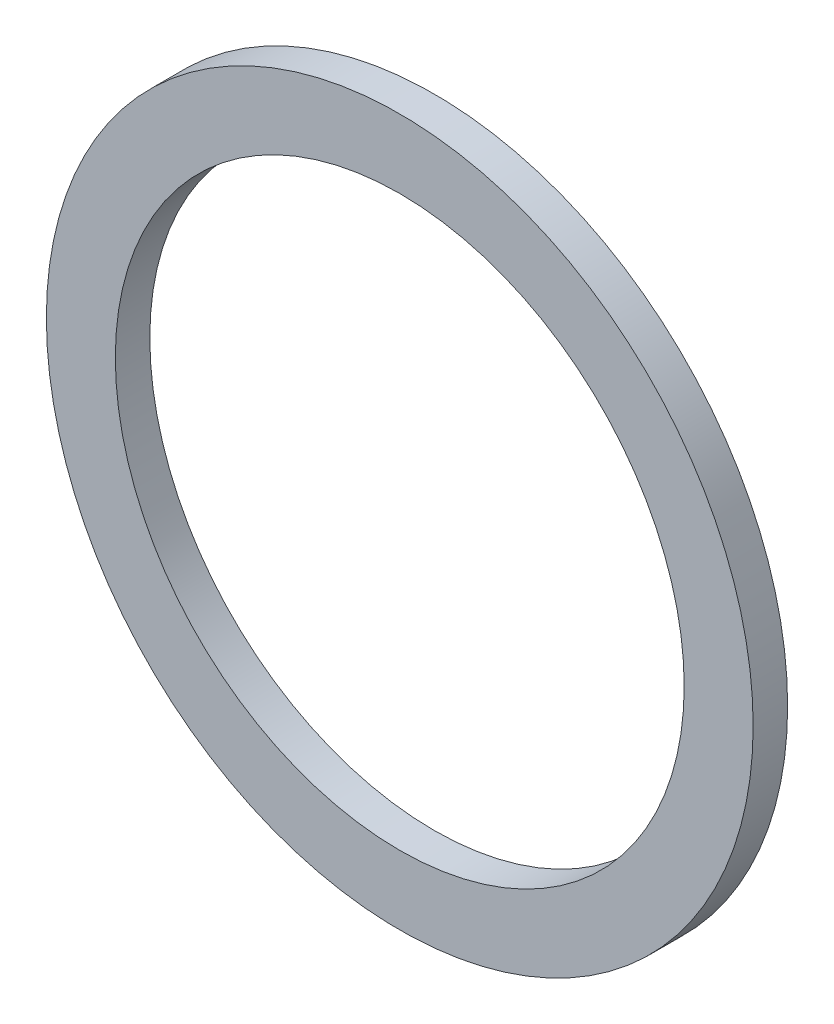
ISO-10303-21;
HEADER;
FILE_DESCRIPTION(('STEP AP214'),'2;1');
FILE_NAME('part.step','',(''),(''),'','','');
FILE_SCHEMA(('AUTOMOTIVE_DESIGN { 1 0 10303 214 1 1 1 1 }'));
ENDSEC;
DATA;
#1=APPLICATION_CONTEXT('core data for automotive mechanical design processes');
#2=APPLICATION_PROTOCOL_DEFINITION('international standard','automotive_design',2000,#1);
#3=PRODUCT_CONTEXT('',#1,'mechanical');
#4=PRODUCT('Part','Part','',(#3));
#5=PRODUCT_RELATED_PRODUCT_CATEGORY('part','',(#4));
#6=PRODUCT_DEFINITION_FORMATION('','',#4);
#7=PRODUCT_DEFINITION_CONTEXT('part definition',#1,'design');
#8=PRODUCT_DEFINITION('design','',#6,#7);
#9=PRODUCT_DEFINITION_SHAPE('','',#8);
#10=(LENGTH_UNIT() NAMED_UNIT(*) SI_UNIT(.MILLI.,.METRE.));
#11=(NAMED_UNIT(*) PLANE_ANGLE_UNIT() SI_UNIT($,.RADIAN.));
#12=(NAMED_UNIT(*) SI_UNIT($,.STERADIAN.) SOLID_ANGLE_UNIT());
#13=UNCERTAINTY_MEASURE_WITH_UNIT(LENGTH_MEASURE(1.E-05),#10,'distance_accuracy_value','');
#14=(GEOMETRIC_REPRESENTATION_CONTEXT(3) GLOBAL_UNCERTAINTY_ASSIGNED_CONTEXT((#13)) GLOBAL_UNIT_ASSIGNED_CONTEXT((#10,
#11,#12)) REPRESENTATION_CONTEXT('',''));
#15=CARTESIAN_POINT('',(0.,0.,0.));
#16=DIRECTION('',(0.,0.,1.));
#17=DIRECTION('',(1.,0.,0.));
#18=AXIS2_PLACEMENT_3D('',#15,#16,#17);
#19=CARTESIAN_POINT('',(0.,0.,0.5));
#20=DIRECTION('',(0.,0.,1.));
#21=DIRECTION('',(1.,0.,0.));
#22=AXIS2_PLACEMENT_3D('',#19,#20,#21);
#23=PLANE('',#22);
#24=CARTESIAN_POINT('',(0.,0.,0.5));
#25=DIRECTION('',(0.,0.,1.));
#26=DIRECTION('',(1.,0.,0.));
#27=AXIS2_PLACEMENT_3D('',#24,#25,#26);
#28=CIRCLE('',#27,10.25);
#29=CARTESIAN_POINT('',(10.25,0.,0.5));
#30=VERTEX_POINT('',#29);
#31=EDGE_CURVE('E10',#30,#30,#28,.T.);
#32=ORIENTED_EDGE('',*,*,#31,.T.);
#33=EDGE_LOOP('',(#32));
#34=FACE_BOUND('',#33,.T.);
#35=CARTESIAN_POINT('',(0.,0.,0.5));
#36=DIRECTION('',(0.,0.,1.));
#37=DIRECTION('',(1.,0.,0.));
#38=AXIS2_PLACEMENT_3D('',#35,#36,#37);
#39=CIRCLE('',#38,8.25);
#40=CARTESIAN_POINT('',(8.25,0.,0.5));
#41=VERTEX_POINT('',#40);
#42=EDGE_CURVE('E35',#41,#41,#39,.T.);
#43=ORIENTED_EDGE('',*,*,#42,.F.);
#44=EDGE_LOOP('',(#43));
#45=FACE_BOUND('',#44,.T.);
#46=ADVANCED_FACE('F24',(#34,#45),#23,.T.);
#47=CARTESIAN_POINT('',(0.,0.,-0.5));
#48=DIRECTION('',(0.,0.,1.));
#49=DIRECTION('',(1.,0.,0.));
#50=AXIS2_PLACEMENT_3D('',#47,#48,#49);
#51=PLANE('',#50);
#52=CARTESIAN_POINT('',(0.,0.,-0.5));
#53=DIRECTION('',(0.,0.,1.));
#54=DIRECTION('',(1.,0.,0.));
#55=AXIS2_PLACEMENT_3D('',#52,#53,#54);
#56=CIRCLE('',#55,10.25);
#57=CARTESIAN_POINT('',(10.25,0.,-0.5));
#58=VERTEX_POINT('',#57);
#59=EDGE_CURVE('E31',#58,#58,#56,.T.);
#60=ORIENTED_EDGE('',*,*,#59,.F.);
#61=EDGE_LOOP('',(#60));
#62=FACE_BOUND('',#61,.T.);
#63=CARTESIAN_POINT('',(0.,0.,-0.5));
#64=DIRECTION('',(0.,0.,1.));
#65=DIRECTION('',(1.,0.,0.));
#66=AXIS2_PLACEMENT_3D('',#63,#64,#65);
#67=CIRCLE('',#66,8.25);
#68=CARTESIAN_POINT('',(8.25,0.,-0.5));
#69=VERTEX_POINT('',#68);
#70=EDGE_CURVE('E39',#69,#69,#67,.T.);
#71=ORIENTED_EDGE('',*,*,#70,.T.);
#72=EDGE_LOOP('',(#71));
#73=FACE_BOUND('',#72,.T.);
#74=ADVANCED_FACE('F45',(#62,#73),#51,.F.);
#75=CARTESIAN_POINT('',(0.,0.,0.5));
#76=DIRECTION('',(0.,0.,-1.));
#77=DIRECTION('',(-1.,0.,0.));
#78=AXIS2_PLACEMENT_3D('',#75,#76,#77);
#79=CYLINDRICAL_SURFACE('',#78,10.25);
#80=ORIENTED_EDGE('',*,*,#31,.F.);
#81=EDGE_LOOP('',(#80));
#82=FACE_BOUND('',#81,.T.);
#83=ORIENTED_EDGE('',*,*,#59,.T.);
#84=EDGE_LOOP('',(#83));
#85=FACE_BOUND('',#84,.T.);
#86=ADVANCED_FACE('F26',(#82,#85),#79,.T.);
#87=CARTESIAN_POINT('',(0.,0.,0.5));
#88=DIRECTION('',(0.,0.,-1.));
#89=DIRECTION('',(-1.,0.,0.));
#90=AXIS2_PLACEMENT_3D('',#87,#88,#89);
#91=CYLINDRICAL_SURFACE('',#90,8.25);
#92=ORIENTED_EDGE('',*,*,#42,.T.);
#93=EDGE_LOOP('',(#92));
#94=FACE_BOUND('',#93,.T.);
#95=ORIENTED_EDGE('',*,*,#70,.F.);
#96=EDGE_LOOP('',(#95));
#97=FACE_BOUND('',#96,.T.);
#98=ADVANCED_FACE('F47',(#94,#97),#91,.F.);
#99=CLOSED_SHELL('',(#46,#74,#86,#98));
#100=MANIFOLD_SOLID_BREP('B2',#99);
#101=ADVANCED_BREP_SHAPE_REPRESENTATION('',(#18,#100),#14);
#102=SHAPE_DEFINITION_REPRESENTATION(#9,#101);
ENDSEC;
END-ISO-10303-21;
